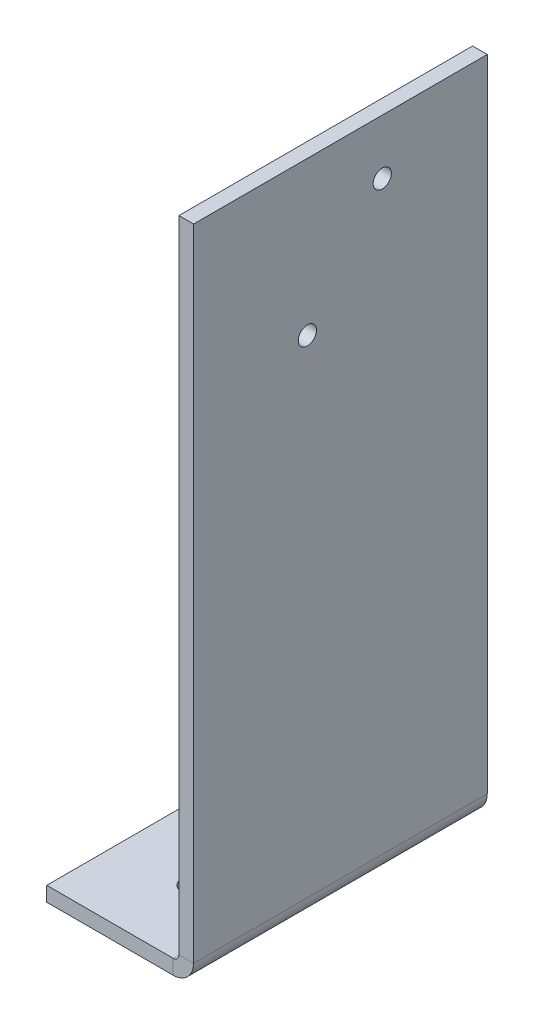
ISO-10303-21;
HEADER;
FILE_DESCRIPTION(('STEP AP214'),'2;1');
FILE_NAME('part.step','',(''),(''),'','','');
FILE_SCHEMA(('AUTOMOTIVE_DESIGN { 1 0 10303 214 1 1 1 1 }'));
ENDSEC;
DATA;
#1=APPLICATION_CONTEXT('core data for automotive mechanical design processes');
#2=APPLICATION_PROTOCOL_DEFINITION('international standard','automotive_design',2000,#1);
#3=PRODUCT_CONTEXT('',#1,'mechanical');
#4=PRODUCT('Part','Part','',(#3));
#5=PRODUCT_RELATED_PRODUCT_CATEGORY('part','',(#4));
#6=PRODUCT_DEFINITION_FORMATION('','',#4);
#7=PRODUCT_DEFINITION_CONTEXT('part definition',#1,'design');
#8=PRODUCT_DEFINITION('design','',#6,#7);
#9=PRODUCT_DEFINITION_SHAPE('','',#8);
#10=(LENGTH_UNIT() NAMED_UNIT(*) SI_UNIT(.MILLI.,.METRE.));
#11=(NAMED_UNIT(*) PLANE_ANGLE_UNIT() SI_UNIT($,.RADIAN.));
#12=(NAMED_UNIT(*) SI_UNIT($,.STERADIAN.) SOLID_ANGLE_UNIT());
#13=UNCERTAINTY_MEASURE_WITH_UNIT(LENGTH_MEASURE(1.E-05),#10,'distance_accuracy_value','');
#14=(GEOMETRIC_REPRESENTATION_CONTEXT(3) GLOBAL_UNCERTAINTY_ASSIGNED_CONTEXT((#13)) GLOBAL_UNIT_ASSIGNED_CONTEXT((#10,
#11,#12)) REPRESENTATION_CONTEXT('',''));
#15=CARTESIAN_POINT('',(0.,0.,0.));
#16=DIRECTION('',(0.,0.,1.));
#17=DIRECTION('',(1.,0.,0.));
#18=AXIS2_PLACEMENT_3D('',#15,#16,#17);
#19=CARTESIAN_POINT('',(0.,-2.54,-50.8));
#20=DIRECTION('',(0.,0.,-1.));
#21=DIRECTION('',(-1.,0.,0.));
#22=AXIS2_PLACEMENT_3D('',#19,#20,#21);
#23=PLANE('',#22);
#24=DIRECTION('',(-1.,0.,0.));
#25=VECTOR('',#24,1.);
#26=CARTESIAN_POINT('',(0.,0.,-50.8));
#27=LINE('',#26,#25);
#28=CARTESIAN_POINT('',(21.86,0.,-50.8));
#29=VERTEX_POINT('',#28);
#30=CARTESIAN_POINT('',(0.,0.,-50.8));
#31=VERTEX_POINT('',#30);
#32=EDGE_CURVE('E97',#29,#31,#27,.T.);
#33=ORIENTED_EDGE('',*,*,#32,.F.);
#34=DIRECTION('',(0.,-1.,0.));
#35=VECTOR('',#34,1.);
#36=CARTESIAN_POINT('',(21.86,0.,-50.8));
#37=LINE('',#36,#35);
#38=CARTESIAN_POINT('',(21.86,-2.54,-50.8));
#39=VERTEX_POINT('',#38);
#40=EDGE_CURVE('E115',#29,#39,#37,.T.);
#41=ORIENTED_EDGE('',*,*,#40,.T.);
#42=DIRECTION('',(-1.,0.,0.));
#43=VECTOR('',#42,1.);
#44=CARTESIAN_POINT('',(0.,-2.54,-50.8));
#45=LINE('',#44,#43);
#46=CARTESIAN_POINT('',(0.,-2.54,-50.8));
#47=VERTEX_POINT('',#46);
#48=EDGE_CURVE('E82',#39,#47,#45,.T.);
#49=ORIENTED_EDGE('',*,*,#48,.T.);
#50=DIRECTION('',(0.,1.,0.));
#51=VECTOR('',#50,1.);
#52=CARTESIAN_POINT('',(0.,-2.54,-50.8));
#53=LINE('',#52,#51);
#54=EDGE_CURVE('E13',#47,#31,#53,.T.);
#55=ORIENTED_EDGE('',*,*,#54,.T.);
#56=EDGE_LOOP('',(#33,#41,#49,#55));
#57=FACE_BOUND('',#56,.T.);
#58=ADVANCED_FACE('F57',(#57),#23,.T.);
#59=CARTESIAN_POINT('',(0.,-2.54,0.));
#60=DIRECTION('',(0.,-1.,0.));
#61=DIRECTION('',(0.,0.,-1.));
#62=AXIS2_PLACEMENT_3D('',#59,#60,#61);
#63=PLANE('',#62);
#64=CARTESIAN_POINT('',(12.7,-2.54,-38.1));
#65=DIRECTION('',(0.,-1.,0.));
#66=DIRECTION('',(0.,0.,-1.));
#67=AXIS2_PLACEMENT_3D('',#64,#65,#66);
#68=CIRCLE('',#67,2.032);
#69=CARTESIAN_POINT('',(12.7,-2.54,-40.132));
#70=VERTEX_POINT('',#69);
#71=EDGE_CURVE('E122',#70,#70,#68,.T.);
#72=ORIENTED_EDGE('',*,*,#71,.F.);
#73=EDGE_LOOP('',(#72));
#74=FACE_BOUND('',#73,.T.);
#75=CARTESIAN_POINT('',(12.7,-2.54,-12.7));
#76=DIRECTION('',(0.,-1.,0.));
#77=DIRECTION('',(0.,0.,-1.));
#78=AXIS2_PLACEMENT_3D('',#75,#76,#77);
#79=CIRCLE('',#78,2.032);
#80=CARTESIAN_POINT('',(12.7,-2.54,-14.732));
#81=VERTEX_POINT('',#80);
#82=EDGE_CURVE('E128',#81,#81,#79,.T.);
#83=ORIENTED_EDGE('',*,*,#82,.F.);
#84=EDGE_LOOP('',(#83));
#85=FACE_BOUND('',#84,.T.);
#86=ORIENTED_EDGE('',*,*,#48,.F.);
#87=DIRECTION('',(0.,0.,-1.));
#88=VECTOR('',#87,1.);
#89=CARTESIAN_POINT('',(21.86,-2.54,-50.8));
#90=LINE('',#89,#88);
#91=CARTESIAN_POINT('',(21.86,-2.54,0.));
#92=VERTEX_POINT('',#91);
#93=EDGE_CURVE('E174',#39,#92,#90,.F.);
#94=ORIENTED_EDGE('',*,*,#93,.T.);
#95=DIRECTION('',(1.,0.,0.));
#96=VECTOR('',#95,1.);
#97=CARTESIAN_POINT('',(0.,-2.54,0.));
#98=LINE('',#97,#96);
#99=CARTESIAN_POINT('',(0.,-2.54,0.));
#100=VERTEX_POINT('',#99);
#101=EDGE_CURVE('E188',#100,#92,#98,.T.);
#102=ORIENTED_EDGE('',*,*,#101,.F.);
#103=DIRECTION('',(0.,0.,1.));
#104=VECTOR('',#103,1.);
#105=CARTESIAN_POINT('',(0.,-2.54,0.));
#106=LINE('',#105,#104);
#107=EDGE_CURVE('E105',#47,#100,#106,.T.);
#108=ORIENTED_EDGE('',*,*,#107,.F.);
#109=EDGE_LOOP('',(#86,#94,#102,#108));
#110=FACE_BOUND('',#109,.T.);
#111=ADVANCED_FACE('F196',(#74,#85,#110),#63,.T.);
#112=CARTESIAN_POINT('',(0.,0.,0.));
#113=DIRECTION('',(0.,-1.,0.));
#114=DIRECTION('',(0.,0.,-1.));
#115=AXIS2_PLACEMENT_3D('',#112,#113,#114);
#116=PLANE('',#115);
#117=CARTESIAN_POINT('',(12.7,0.,-38.1));
#118=DIRECTION('',(0.,-1.,0.));
#119=DIRECTION('',(0.,0.,-1.));
#120=AXIS2_PLACEMENT_3D('',#117,#118,#119);
#121=CIRCLE('',#120,2.032);
#122=CARTESIAN_POINT('',(12.7,0.,-40.132));
#123=VERTEX_POINT('',#122);
#124=EDGE_CURVE('E61',#123,#123,#121,.T.);
#125=ORIENTED_EDGE('',*,*,#124,.T.);
#126=EDGE_LOOP('',(#125));
#127=FACE_BOUND('',#126,.T.);
#128=CARTESIAN_POINT('',(12.7,0.,-12.7));
#129=DIRECTION('',(0.,-1.,0.));
#130=DIRECTION('',(0.,0.,-1.));
#131=AXIS2_PLACEMENT_3D('',#128,#129,#130);
#132=CIRCLE('',#131,2.032);
#133=CARTESIAN_POINT('',(12.7,0.,-14.732));
#134=VERTEX_POINT('',#133);
#135=EDGE_CURVE('E120',#134,#134,#132,.T.);
#136=ORIENTED_EDGE('',*,*,#135,.T.);
#137=EDGE_LOOP('',(#136));
#138=FACE_BOUND('',#137,.T.);
#139=DIRECTION('',(0.,0.,-1.));
#140=VECTOR('',#139,1.);
#141=CARTESIAN_POINT('',(21.86,0.,-50.8));
#142=LINE('',#141,#140);
#143=CARTESIAN_POINT('',(21.86,0.,0.));
#144=VERTEX_POINT('',#143);
#145=EDGE_CURVE('E104',#29,#144,#142,.F.);
#146=ORIENTED_EDGE('',*,*,#145,.F.);
#147=ORIENTED_EDGE('',*,*,#32,.T.);
#148=DIRECTION('',(0.,0.,1.));
#149=VECTOR('',#148,1.);
#150=CARTESIAN_POINT('',(0.,0.,0.));
#151=LINE('',#150,#149);
#152=CARTESIAN_POINT('',(0.,0.,0.));
#153=VERTEX_POINT('',#152);
#154=EDGE_CURVE('E101',#31,#153,#151,.T.);
#155=ORIENTED_EDGE('',*,*,#154,.T.);
#156=DIRECTION('',(1.,0.,0.));
#157=VECTOR('',#156,1.);
#158=CARTESIAN_POINT('',(0.,0.,0.));
#159=LINE('',#158,#157);
#160=EDGE_CURVE('E106',#153,#144,#159,.T.);
#161=ORIENTED_EDGE('',*,*,#160,.T.);
#162=EDGE_LOOP('',(#146,#147,#155,#161));
#163=FACE_BOUND('',#162,.T.);
#164=ADVANCED_FACE('F98',(#127,#138,#163),#116,.F.);
#165=CARTESIAN_POINT('',(0.,-2.54,0.));
#166=DIRECTION('',(-1.,0.,0.));
#167=DIRECTION('',(0.,0.,1.));
#168=AXIS2_PLACEMENT_3D('',#165,#166,#167);
#169=PLANE('',#168);
#170=ORIENTED_EDGE('',*,*,#154,.F.);
#171=ORIENTED_EDGE('',*,*,#54,.F.);
#172=ORIENTED_EDGE('',*,*,#107,.T.);
#173=DIRECTION('',(0.,1.,0.));
#174=VECTOR('',#173,1.);
#175=CARTESIAN_POINT('',(0.,-2.54,0.));
#176=LINE('',#175,#174);
#177=EDGE_CURVE('E66',#100,#153,#176,.T.);
#178=ORIENTED_EDGE('',*,*,#177,.T.);
#179=EDGE_LOOP('',(#170,#171,#172,#178));
#180=FACE_BOUND('',#179,.T.);
#181=ADVANCED_FACE('F59',(#180),#169,.T.);
#182=CARTESIAN_POINT('',(0.,-2.54,0.));
#183=DIRECTION('',(0.,0.,1.));
#184=DIRECTION('',(1.,0.,0.));
#185=AXIS2_PLACEMENT_3D('',#182,#183,#184);
#186=PLANE('',#185);
#187=DIRECTION('',(0.,-1.,0.));
#188=VECTOR('',#187,1.);
#189=CARTESIAN_POINT('',(21.86,0.,0.));
#190=LINE('',#189,#188);
#191=EDGE_CURVE('E112',#144,#92,#190,.T.);
#192=ORIENTED_EDGE('',*,*,#191,.F.);
#193=ORIENTED_EDGE('',*,*,#160,.F.);
#194=ORIENTED_EDGE('',*,*,#177,.F.);
#195=ORIENTED_EDGE('',*,*,#101,.T.);
#196=EDGE_LOOP('',(#192,#193,#194,#195));
#197=FACE_BOUND('',#196,.T.);
#198=ADVANCED_FACE('F193',(#197),#186,.T.);
#199=CARTESIAN_POINT('',(21.86,1.,0.));
#200=DIRECTION('',(0.,0.,1.));
#201=DIRECTION('',(1.,0.,0.));
#202=AXIS2_PLACEMENT_3D('',#199,#200,#201);
#203=PLANE('',#202);
#204=DIRECTION('',(-1.,0.,0.));
#205=VECTOR('',#204,1.);
#206=CARTESIAN_POINT('',(25.4,0.999999999999989,0.));
#207=LINE('',#206,#205);
#208=CARTESIAN_POINT('',(22.86,0.999999999999997,0.));
#209=VERTEX_POINT('',#208);
#210=CARTESIAN_POINT('',(25.4,0.999999999999989,0.));
#211=VERTEX_POINT('',#210);
#212=EDGE_CURVE('E126',#209,#211,#207,.F.);
#213=ORIENTED_EDGE('',*,*,#212,.F.);
#214=CARTESIAN_POINT('',(21.86,1.,0.));
#215=DIRECTION('',(0.,0.,-1.));
#216=DIRECTION('',(-1.,0.,0.));
#217=AXIS2_PLACEMENT_3D('',#214,#215,#216);
#218=CIRCLE('',#217,1.);
#219=EDGE_CURVE('E181',#144,#209,#218,.F.);
#220=ORIENTED_EDGE('',*,*,#219,.F.);
#221=ORIENTED_EDGE('',*,*,#191,.T.);
#222=CARTESIAN_POINT('',(21.86,1.,0.));
#223=DIRECTION('',(0.,0.,-1.));
#224=DIRECTION('',(-1.,0.,0.));
#225=AXIS2_PLACEMENT_3D('',#222,#223,#224);
#226=CIRCLE('',#225,3.54);
#227=EDGE_CURVE('E74',#92,#211,#226,.F.);
#228=ORIENTED_EDGE('',*,*,#227,.T.);
#229=EDGE_LOOP('',(#213,#220,#221,#228));
#230=FACE_BOUND('',#229,.T.);
#231=ADVANCED_FACE('F247',(#230),#203,.T.);
#232=CARTESIAN_POINT('',(21.86,1.,-50.8));
#233=DIRECTION('',(0.,0.,1.));
#234=DIRECTION('',(1.,0.,0.));
#235=AXIS2_PLACEMENT_3D('',#232,#233,#234);
#236=PLANE('',#235);
#237=CARTESIAN_POINT('',(21.86,1.,-50.8));
#238=DIRECTION('',(0.,0.,-1.));
#239=DIRECTION('',(-1.,0.,0.));
#240=AXIS2_PLACEMENT_3D('',#237,#238,#239);
#241=CIRCLE('',#240,1.);
#242=CARTESIAN_POINT('',(22.86,0.999999999999997,-50.8));
#243=VERTEX_POINT('',#242);
#244=EDGE_CURVE('E142',#243,#29,#241,.T.);
#245=ORIENTED_EDGE('',*,*,#244,.F.);
#246=DIRECTION('',(-1.,0.,0.));
#247=VECTOR('',#246,1.);
#248=CARTESIAN_POINT('',(22.86,0.999999999999997,-50.8));
#249=LINE('',#248,#247);
#250=CARTESIAN_POINT('',(25.4,0.999999999999989,-50.8));
#251=VERTEX_POINT('',#250);
#252=EDGE_CURVE('E166',#243,#251,#249,.F.);
#253=ORIENTED_EDGE('',*,*,#252,.T.);
#254=CARTESIAN_POINT('',(21.86,1.,-50.8));
#255=DIRECTION('',(0.,0.,-1.));
#256=DIRECTION('',(-1.,0.,0.));
#257=AXIS2_PLACEMENT_3D('',#254,#255,#256);
#258=CIRCLE('',#257,3.54);
#259=EDGE_CURVE('E177',#251,#39,#258,.T.);
#260=ORIENTED_EDGE('',*,*,#259,.T.);
#261=ORIENTED_EDGE('',*,*,#40,.F.);
#262=EDGE_LOOP('',(#245,#253,#260,#261));
#263=FACE_BOUND('',#262,.T.);
#264=ADVANCED_FACE('F205',(#263),#236,.F.);
#265=CARTESIAN_POINT('',(21.86,1.,-50.8));
#266=DIRECTION('',(0.,0.,-1.));
#267=DIRECTION('',(1.,0.,0.));
#268=AXIS2_PLACEMENT_3D('',#265,#266,#267);
#269=CYLINDRICAL_SURFACE('',#268,3.54);
#270=ORIENTED_EDGE('',*,*,#93,.F.);
#271=ORIENTED_EDGE('',*,*,#259,.F.);
#272=DIRECTION('',(0.,0.,-1.));
#273=VECTOR('',#272,1.);
#274=CARTESIAN_POINT('',(25.4,0.999999999999989,0.));
#275=LINE('',#274,#273);
#276=EDGE_CURVE('E164',#251,#211,#275,.F.);
#277=ORIENTED_EDGE('',*,*,#276,.T.);
#278=ORIENTED_EDGE('',*,*,#227,.F.);
#279=EDGE_LOOP('',(#270,#271,#277,#278));
#280=FACE_BOUND('',#279,.T.);
#281=ADVANCED_FACE('F198',(#280),#269,.T.);
#282=CARTESIAN_POINT('',(21.86,1.,-50.8));
#283=DIRECTION('',(0.,0.,-1.));
#284=DIRECTION('',(1.,0.,0.));
#285=AXIS2_PLACEMENT_3D('',#282,#283,#284);
#286=CYLINDRICAL_SURFACE('',#285,1.);
#287=ORIENTED_EDGE('',*,*,#145,.T.);
#288=ORIENTED_EDGE('',*,*,#219,.T.);
#289=DIRECTION('',(0.,0.,-1.));
#290=VECTOR('',#289,1.);
#291=CARTESIAN_POINT('',(22.86,0.999999999999997,0.));
#292=LINE('',#291,#290);
#293=EDGE_CURVE('E169',#209,#243,#292,.T.);
#294=ORIENTED_EDGE('',*,*,#293,.T.);
#295=ORIENTED_EDGE('',*,*,#244,.T.);
#296=EDGE_LOOP('',(#287,#288,#294,#295));
#297=FACE_BOUND('',#296,.T.);
#298=ADVANCED_FACE('F239',(#297),#286,.F.);
#299=CARTESIAN_POINT('',(25.4000000000004,111.76,-50.8));
#300=DIRECTION('',(0.,0.,1.));
#301=DIRECTION('',(0.,-1.,0.));
#302=AXIS2_PLACEMENT_3D('',#299,#300,#301);
#303=PLANE('',#302);
#304=ORIENTED_EDGE('',*,*,#252,.F.);
#305=DIRECTION('',(0.,-1.,0.));
#306=VECTOR('',#305,1.);
#307=CARTESIAN_POINT('',(22.8600000000004,111.76,-50.8));
#308=LINE('',#307,#306);
#309=CARTESIAN_POINT('',(22.8600000000004,111.76,-50.8));
#310=VERTEX_POINT('',#309);
#311=EDGE_CURVE('E161',#243,#310,#308,.F.);
#312=ORIENTED_EDGE('',*,*,#311,.T.);
#313=DIRECTION('',(-1.,0.,0.));
#314=VECTOR('',#313,1.);
#315=CARTESIAN_POINT('',(25.4000000000004,111.76,-50.8));
#316=LINE('',#315,#314);
#317=CARTESIAN_POINT('',(25.4000000000004,111.76,-50.8));
#318=VERTEX_POINT('',#317);
#319=EDGE_CURVE('E139',#318,#310,#316,.T.);
#320=ORIENTED_EDGE('',*,*,#319,.F.);
#321=DIRECTION('',(0.,1.,0.));
#322=VECTOR('',#321,1.);
#323=CARTESIAN_POINT('',(25.4,0.,-50.8));
#324=LINE('',#323,#322);
#325=EDGE_CURVE('E152',#251,#318,#324,.T.);
#326=ORIENTED_EDGE('',*,*,#325,.F.);
#327=EDGE_LOOP('',(#304,#312,#320,#326));
#328=FACE_BOUND('',#327,.T.);
#329=ADVANCED_FACE('F219',(#328),#303,.F.);
#330=CARTESIAN_POINT('',(25.4,0.,0.));
#331=DIRECTION('',(0.,0.,-1.));
#332=DIRECTION('',(-1.,0.,0.));
#333=AXIS2_PLACEMENT_3D('',#330,#331,#332);
#334=PLANE('',#333);
#335=ORIENTED_EDGE('',*,*,#212,.T.);
#336=DIRECTION('',(0.,-1.,0.));
#337=VECTOR('',#336,1.);
#338=CARTESIAN_POINT('',(25.4,0.,0.));
#339=LINE('',#338,#337);
#340=CARTESIAN_POINT('',(25.4000000000004,111.76,0.));
#341=VERTEX_POINT('',#340);
#342=EDGE_CURVE('E146',#341,#211,#339,.T.);
#343=ORIENTED_EDGE('',*,*,#342,.F.);
#344=DIRECTION('',(-1.,0.,0.));
#345=VECTOR('',#344,1.);
#346=CARTESIAN_POINT('',(25.4000000000004,111.76,0.));
#347=LINE('',#346,#345);
#348=CARTESIAN_POINT('',(22.8600000000004,111.76,0.));
#349=VERTEX_POINT('',#348);
#350=EDGE_CURVE('E143',#341,#349,#347,.T.);
#351=ORIENTED_EDGE('',*,*,#350,.T.);
#352=DIRECTION('',(0.,1.,0.));
#353=VECTOR('',#352,1.);
#354=CARTESIAN_POINT('',(22.86,0.,0.));
#355=LINE('',#354,#353);
#356=EDGE_CURVE('E155',#349,#209,#355,.F.);
#357=ORIENTED_EDGE('',*,*,#356,.T.);
#358=EDGE_LOOP('',(#335,#343,#351,#357));
#359=FACE_BOUND('',#358,.T.);
#360=ADVANCED_FACE('F245',(#359),#334,.F.);
#361=CARTESIAN_POINT('',(25.4,0.,0.));
#362=DIRECTION('',(-1.,0.,0.));
#363=DIRECTION('',(0.,-1.,0.));
#364=AXIS2_PLACEMENT_3D('',#361,#362,#363);
#365=PLANE('',#364);
#366=CARTESIAN_POINT('',(25.4000000000008,102.2604,-32.639));
#367=DIRECTION('',(-1.,0.,0.));
#368=DIRECTION('',(0.,-1.,0.));
#369=AXIS2_PLACEMENT_3D('',#366,#367,#368);
#370=CIRCLE('',#369,1.5748);
#371=CARTESIAN_POINT('',(25.4000000000007,100.6856,-32.639));
#372=VERTEX_POINT('',#371);
#373=EDGE_CURVE('E133',#372,#372,#370,.T.);
#374=ORIENTED_EDGE('',*,*,#373,.T.);
#375=EDGE_LOOP('',(#374));
#376=FACE_BOUND('',#375,.T.);
#377=CARTESIAN_POINT('',(25.4000000000007,85.2424,-19.685));
#378=DIRECTION('',(-1.,0.,0.));
#379=DIRECTION('',(0.,-1.,0.));
#380=AXIS2_PLACEMENT_3D('',#377,#378,#379);
#381=CIRCLE('',#380,1.5748);
#382=CARTESIAN_POINT('',(25.4000000000007,83.6676,-19.685));
#383=VERTEX_POINT('',#382);
#384=EDGE_CURVE('E367',#383,#383,#381,.T.);
#385=ORIENTED_EDGE('',*,*,#384,.T.);
#386=EDGE_LOOP('',(#385));
#387=FACE_BOUND('',#386,.T.);
#388=ORIENTED_EDGE('',*,*,#276,.F.);
#389=ORIENTED_EDGE('',*,*,#325,.T.);
#390=DIRECTION('',(0.,0.,1.));
#391=VECTOR('',#390,1.);
#392=CARTESIAN_POINT('',(25.4000000000004,111.76,0.));
#393=LINE('',#392,#391);
#394=EDGE_CURVE('E149',#318,#341,#393,.T.);
#395=ORIENTED_EDGE('',*,*,#394,.T.);
#396=ORIENTED_EDGE('',*,*,#342,.T.);
#397=EDGE_LOOP('',(#388,#389,#395,#396));
#398=FACE_BOUND('',#397,.T.);
#399=ADVANCED_FACE('F215',(#376,#387,#398),#365,.F.);
#400=CARTESIAN_POINT('',(22.86,0.,0.));
#401=DIRECTION('',(-1.,0.,0.));
#402=DIRECTION('',(0.,-1.,0.));
#403=AXIS2_PLACEMENT_3D('',#400,#401,#402);
#404=PLANE('',#403);
#405=CARTESIAN_POINT('',(22.8600000000004,102.2604,-32.639));
#406=DIRECTION('',(-1.,0.,0.));
#407=DIRECTION('',(0.,-1.,0.));
#408=AXIS2_PLACEMENT_3D('',#405,#406,#407);
#409=CIRCLE('',#408,1.5748);
#410=CARTESIAN_POINT('',(22.8600000000003,100.6856,-32.639));
#411=VERTEX_POINT('',#410);
#412=EDGE_CURVE('E366',#411,#411,#409,.T.);
#413=ORIENTED_EDGE('',*,*,#412,.F.);
#414=EDGE_LOOP('',(#413));
#415=FACE_BOUND('',#414,.T.);
#416=CARTESIAN_POINT('',(22.8600000000003,85.2424,-19.685));
#417=DIRECTION('',(-1.,0.,0.));
#418=DIRECTION('',(0.,-1.,0.));
#419=AXIS2_PLACEMENT_3D('',#416,#417,#418);
#420=CIRCLE('',#419,1.5748);
#421=CARTESIAN_POINT('',(22.8600000000003,83.6676,-19.685));
#422=VERTEX_POINT('',#421);
#423=EDGE_CURVE('E136',#422,#422,#420,.T.);
#424=ORIENTED_EDGE('',*,*,#423,.F.);
#425=EDGE_LOOP('',(#424));
#426=FACE_BOUND('',#425,.T.);
#427=ORIENTED_EDGE('',*,*,#311,.F.);
#428=ORIENTED_EDGE('',*,*,#293,.F.);
#429=ORIENTED_EDGE('',*,*,#356,.F.);
#430=DIRECTION('',(0.,0.,-1.));
#431=VECTOR('',#430,1.);
#432=CARTESIAN_POINT('',(22.8600000000004,111.76,0.));
#433=LINE('',#432,#431);
#434=EDGE_CURVE('E158',#310,#349,#433,.F.);
#435=ORIENTED_EDGE('',*,*,#434,.F.);
#436=EDGE_LOOP('',(#427,#428,#429,#435));
#437=FACE_BOUND('',#436,.T.);
#438=ADVANCED_FACE('F243',(#415,#426,#437),#404,.T.);
#439=CARTESIAN_POINT('',(25.4000000000004,111.76,0.));
#440=DIRECTION('',(0.,-1.,0.));
#441=DIRECTION('',(1.,0.,0.));
#442=AXIS2_PLACEMENT_3D('',#439,#440,#441);
#443=PLANE('',#442);
#444=ORIENTED_EDGE('',*,*,#434,.T.);
#445=ORIENTED_EDGE('',*,*,#350,.F.);
#446=ORIENTED_EDGE('',*,*,#394,.F.);
#447=ORIENTED_EDGE('',*,*,#319,.T.);
#448=EDGE_LOOP('',(#444,#445,#446,#447));
#449=FACE_BOUND('',#448,.T.);
#450=ADVANCED_FACE('F227',(#449),#443,.F.);
#451=CARTESIAN_POINT('',(12.7,111.76,-12.7));
#452=DIRECTION('',(0.,-1.,0.));
#453=DIRECTION('',(0.,0.,-1.));
#454=AXIS2_PLACEMENT_3D('',#451,#452,#453);
#455=CYLINDRICAL_SURFACE('',#454,2.032);
#456=ORIENTED_EDGE('',*,*,#82,.T.);
#457=EDGE_LOOP('',(#456));
#458=FACE_BOUND('',#457,.T.);
#459=ORIENTED_EDGE('',*,*,#135,.F.);
#460=EDGE_LOOP('',(#459));
#461=FACE_BOUND('',#460,.T.);
#462=ADVANCED_FACE('F274',(#458,#461),#455,.F.);
#463=CARTESIAN_POINT('',(12.7,111.76,-38.1));
#464=DIRECTION('',(0.,-1.,0.));
#465=DIRECTION('',(0.,0.,-1.));
#466=AXIS2_PLACEMENT_3D('',#463,#464,#465);
#467=CYLINDRICAL_SURFACE('',#466,2.032);
#468=ORIENTED_EDGE('',*,*,#71,.T.);
#469=EDGE_LOOP('',(#468));
#470=FACE_BOUND('',#469,.T.);
#471=ORIENTED_EDGE('',*,*,#124,.F.);
#472=EDGE_LOOP('',(#471));
#473=FACE_BOUND('',#472,.T.);
#474=ADVANCED_FACE('F271',(#470,#473),#467,.F.);
#475=CARTESIAN_POINT('',(25.4000000000007,85.2424,-19.685));
#476=DIRECTION('',(-1.,0.,0.));
#477=DIRECTION('',(0.,-1.,0.));
#478=AXIS2_PLACEMENT_3D('',#475,#476,#477);
#479=CYLINDRICAL_SURFACE('',#478,1.5748);
#480=ORIENTED_EDGE('',*,*,#384,.F.);
#481=EDGE_LOOP('',(#480));
#482=FACE_BOUND('',#481,.T.);
#483=ORIENTED_EDGE('',*,*,#423,.T.);
#484=EDGE_LOOP('',(#483));
#485=FACE_BOUND('',#484,.T.);
#486=ADVANCED_FACE('F273',(#482,#485),#479,.F.);
#487=CARTESIAN_POINT('',(25.4000000000008,102.2604,-32.639));
#488=DIRECTION('',(-1.,0.,0.));
#489=DIRECTION('',(0.,-1.,0.));
#490=AXIS2_PLACEMENT_3D('',#487,#488,#489);
#491=CYLINDRICAL_SURFACE('',#490,1.5748);
#492=ORIENTED_EDGE('',*,*,#373,.F.);
#493=EDGE_LOOP('',(#492));
#494=FACE_BOUND('',#493,.T.);
#495=ORIENTED_EDGE('',*,*,#412,.T.);
#496=EDGE_LOOP('',(#495));
#497=FACE_BOUND('',#496,.T.);
#498=ADVANCED_FACE('F280',(#494,#497),#491,.F.);
#499=CLOSED_SHELL('',(#58,#111,#164,#181,#198,#231,#264,#281,#298,#329,#360,#399,#438,#450,#462,
#474,#486,#498));
#500=MANIFOLD_SOLID_BREP('B2',#499);
#501=ADVANCED_BREP_SHAPE_REPRESENTATION('',(#18,#500),#14);
#502=SHAPE_DEFINITION_REPRESENTATION(#9,#501);
ENDSEC;
END-ISO-10303-21;
